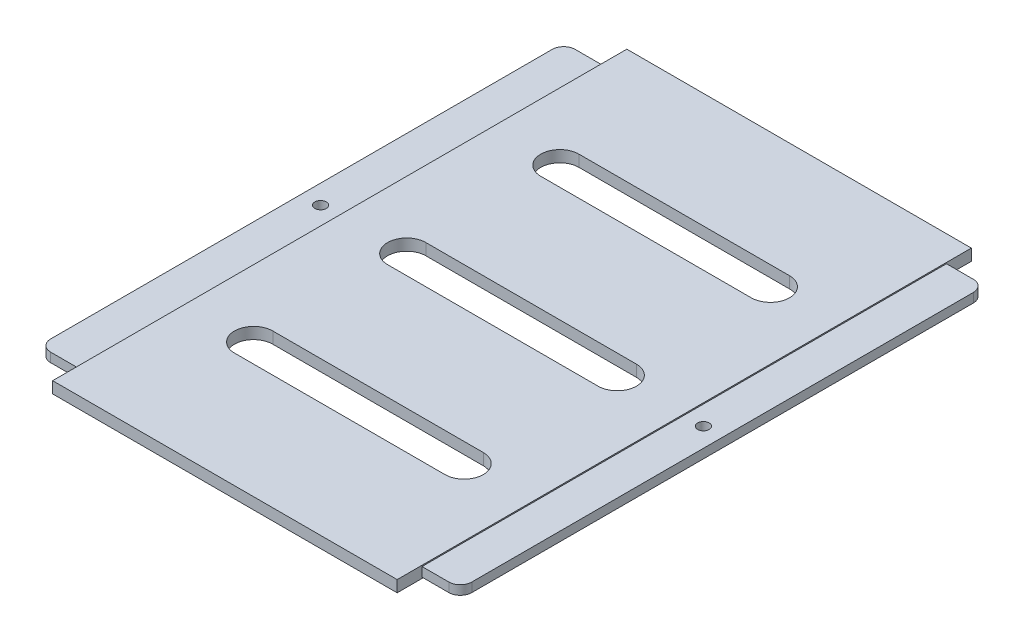
ISO-10303-21;
HEADER;
FILE_DESCRIPTION(('STEP AP214'),'2;1');
FILE_NAME('part.step','',(''),(''),'','','');
FILE_SCHEMA(('AUTOMOTIVE_DESIGN { 1 0 10303 214 1 1 1 1 }'));
ENDSEC;
DATA;
#1=APPLICATION_CONTEXT('core data for automotive mechanical design processes');
#2=APPLICATION_PROTOCOL_DEFINITION('international standard','automotive_design',2000,#1);
#3=PRODUCT_CONTEXT('',#1,'mechanical');
#4=PRODUCT('Part','Part','',(#3));
#5=PRODUCT_RELATED_PRODUCT_CATEGORY('part','',(#4));
#6=PRODUCT_DEFINITION_FORMATION('','',#4);
#7=PRODUCT_DEFINITION_CONTEXT('part definition',#1,'design');
#8=PRODUCT_DEFINITION('design','',#6,#7);
#9=PRODUCT_DEFINITION_SHAPE('','',#8);
#10=(LENGTH_UNIT() NAMED_UNIT(*) SI_UNIT(.MILLI.,.METRE.));
#11=(NAMED_UNIT(*) PLANE_ANGLE_UNIT() SI_UNIT($,.RADIAN.));
#12=(NAMED_UNIT(*) SI_UNIT($,.STERADIAN.) SOLID_ANGLE_UNIT());
#13=UNCERTAINTY_MEASURE_WITH_UNIT(LENGTH_MEASURE(1.E-05),#10,'distance_accuracy_value','');
#14=(GEOMETRIC_REPRESENTATION_CONTEXT(3) GLOBAL_UNCERTAINTY_ASSIGNED_CONTEXT((#13)) GLOBAL_UNIT_ASSIGNED_CONTEXT((#10,
#11,#12)) REPRESENTATION_CONTEXT('',''));
#15=CARTESIAN_POINT('',(0.,0.,0.));
#16=DIRECTION('',(0.,0.,1.));
#17=DIRECTION('',(1.,0.,0.));
#18=AXIS2_PLACEMENT_3D('',#15,#16,#17);
#19=CARTESIAN_POINT('',(45.,3.,-75.));
#20=DIRECTION('',(-1.,0.,0.));
#21=DIRECTION('',(0.,0.,1.));
#22=AXIS2_PLACEMENT_3D('',#19,#20,#21);
#23=PLANE('',#22);
#24=DIRECTION('',(0.,0.,-1.));
#25=VECTOR('',#24,1.);
#26=CARTESIAN_POINT('',(45.,2.7,0.));
#27=LINE('',#26,#25);
#28=CARTESIAN_POINT('',(45.,2.7,68.5));
#29=VERTEX_POINT('',#28);
#30=CARTESIAN_POINT('',(45.,2.7,-68.5));
#31=VERTEX_POINT('',#30);
#32=EDGE_CURVE('E275',#29,#31,#27,.T.);
#33=ORIENTED_EDGE('',*,*,#32,.T.);
#34=DIRECTION('',(0.,-1.,0.));
#35=VECTOR('',#34,1.);
#36=CARTESIAN_POINT('',(45.,0.,-68.5));
#37=LINE('',#36,#35);
#38=CARTESIAN_POINT('',(45.,0.3,-68.5));
#39=VERTEX_POINT('',#38);
#40=EDGE_CURVE('E264',#31,#39,#37,.T.);
#41=ORIENTED_EDGE('',*,*,#40,.T.);
#42=DIRECTION('',(0.,0.,-1.));
#43=VECTOR('',#42,1.);
#44=CARTESIAN_POINT('',(45.,0.3,0.));
#45=LINE('',#44,#43);
#46=CARTESIAN_POINT('',(45.,0.3,68.5));
#47=VERTEX_POINT('',#46);
#48=EDGE_CURVE('E269',#47,#39,#45,.T.);
#49=ORIENTED_EDGE('',*,*,#48,.F.);
#50=DIRECTION('',(0.,-1.,0.));
#51=VECTOR('',#50,1.);
#52=CARTESIAN_POINT('',(45.,0.,68.5));
#53=LINE('',#52,#51);
#54=EDGE_CURVE('E278',#29,#47,#53,.T.);
#55=ORIENTED_EDGE('',*,*,#54,.F.);
#56=EDGE_LOOP('',(#33,#41,#49,#55));
#57=FACE_BOUND('',#56,.T.);
#58=DIRECTION('',(0.,0.,-1.));
#59=VECTOR('',#58,1.);
#60=CARTESIAN_POINT('',(45.,0.,-75.));
#61=LINE('',#60,#59);
#62=CARTESIAN_POINT('',(45.,0.,75.));
#63=VERTEX_POINT('',#62);
#64=CARTESIAN_POINT('',(45.,0.,-75.));
#65=VERTEX_POINT('',#64);
#66=EDGE_CURVE('E318',#63,#65,#61,.T.);
#67=ORIENTED_EDGE('',*,*,#66,.T.);
#68=DIRECTION('',(0.,-1.,0.));
#69=VECTOR('',#68,1.);
#70=CARTESIAN_POINT('',(45.,3.,-75.));
#71=LINE('',#70,#69);
#72=CARTESIAN_POINT('',(45.,3.,-75.));
#73=VERTEX_POINT('',#72);
#74=EDGE_CURVE('E413',#73,#65,#71,.T.);
#75=ORIENTED_EDGE('',*,*,#74,.F.);
#76=DIRECTION('',(0.,0.,-1.));
#77=VECTOR('',#76,1.);
#78=CARTESIAN_POINT('',(45.,3.,-75.));
#79=LINE('',#78,#77);
#80=CARTESIAN_POINT('',(45.,3.,75.));
#81=VERTEX_POINT('',#80);
#82=EDGE_CURVE('E387',#81,#73,#79,.T.);
#83=ORIENTED_EDGE('',*,*,#82,.F.);
#84=DIRECTION('',(0.,-1.,0.));
#85=VECTOR('',#84,1.);
#86=CARTESIAN_POINT('',(45.,3.,75.));
#87=LINE('',#86,#85);
#88=EDGE_CURVE('E397',#81,#63,#87,.T.);
#89=ORIENTED_EDGE('',*,*,#88,.T.);
#90=EDGE_LOOP('',(#67,#75,#83,#89));
#91=FACE_BOUND('',#90,.T.);
#92=ADVANCED_FACE('F44',(#57,#91),#23,.F.);
#93=CARTESIAN_POINT('',(-45.,3.,-75.));
#94=DIRECTION('',(0.,0.,1.));
#95=DIRECTION('',(1.,0.,0.));
#96=AXIS2_PLACEMENT_3D('',#93,#94,#95);
#97=PLANE('',#96);
#98=DIRECTION('',(-1.,0.,0.));
#99=VECTOR('',#98,1.);
#100=CARTESIAN_POINT('',(-45.,0.,-75.));
#101=LINE('',#100,#99);
#102=CARTESIAN_POINT('',(-45.,0.,-75.));
#103=VERTEX_POINT('',#102);
#104=EDGE_CURVE('E400',#65,#103,#101,.T.);
#105=ORIENTED_EDGE('',*,*,#104,.T.);
#106=DIRECTION('',(0.,-1.,0.));
#107=VECTOR('',#106,1.);
#108=CARTESIAN_POINT('',(-45.,3.,-75.));
#109=LINE('',#108,#107);
#110=CARTESIAN_POINT('',(-45.,3.,-75.));
#111=VERTEX_POINT('',#110);
#112=EDGE_CURVE('E410',#111,#103,#109,.T.);
#113=ORIENTED_EDGE('',*,*,#112,.F.);
#114=DIRECTION('',(-1.,0.,0.));
#115=VECTOR('',#114,1.);
#116=CARTESIAN_POINT('',(-45.,3.,-75.));
#117=LINE('',#116,#115);
#118=EDGE_CURVE('E390',#73,#111,#117,.T.);
#119=ORIENTED_EDGE('',*,*,#118,.F.);
#120=ORIENTED_EDGE('',*,*,#74,.T.);
#121=EDGE_LOOP('',(#105,#113,#119,#120));
#122=FACE_BOUND('',#121,.T.);
#123=ADVANCED_FACE('F484',(#122),#97,.F.);
#124=CARTESIAN_POINT('',(-45.,3.,-75.));
#125=DIRECTION('',(1.,0.,0.));
#126=DIRECTION('',(0.,0.,-1.));
#127=AXIS2_PLACEMENT_3D('',#124,#125,#126);
#128=PLANE('',#127);
#129=DIRECTION('',(0.,0.,1.));
#130=VECTOR('',#129,1.);
#131=CARTESIAN_POINT('',(-45.,2.7,0.));
#132=LINE('',#131,#130);
#133=CARTESIAN_POINT('',(-45.,2.7,-68.5000000000002));
#134=VERTEX_POINT('',#133);
#135=CARTESIAN_POINT('',(-45.,2.7,68.4999999999998));
#136=VERTEX_POINT('',#135);
#137=EDGE_CURVE('E242',#134,#136,#132,.T.);
#138=ORIENTED_EDGE('',*,*,#137,.T.);
#139=DIRECTION('',(0.,-1.,0.));
#140=VECTOR('',#139,1.);
#141=CARTESIAN_POINT('',(-45.,0.,68.4999999999998));
#142=LINE('',#141,#140);
#143=CARTESIAN_POINT('',(-45.,0.3,68.4999999999998));
#144=VERTEX_POINT('',#143);
#145=EDGE_CURVE('E248',#136,#144,#142,.T.);
#146=ORIENTED_EDGE('',*,*,#145,.T.);
#147=DIRECTION('',(0.,0.,1.));
#148=VECTOR('',#147,1.);
#149=CARTESIAN_POINT('',(-45.,0.3,0.));
#150=LINE('',#149,#148);
#151=CARTESIAN_POINT('',(-45.,0.3,-68.5000000000002));
#152=VERTEX_POINT('',#151);
#153=EDGE_CURVE('E253',#152,#144,#150,.T.);
#154=ORIENTED_EDGE('',*,*,#153,.F.);
#155=DIRECTION('',(0.,-1.,0.));
#156=VECTOR('',#155,1.);
#157=CARTESIAN_POINT('',(-45.,0.,-68.5000000000002));
#158=LINE('',#157,#156);
#159=EDGE_CURVE('E234',#134,#152,#158,.T.);
#160=ORIENTED_EDGE('',*,*,#159,.F.);
#161=EDGE_LOOP('',(#138,#146,#154,#160));
#162=FACE_BOUND('',#161,.T.);
#163=DIRECTION('',(0.,0.,1.));
#164=VECTOR('',#163,1.);
#165=CARTESIAN_POINT('',(-45.,0.,-75.));
#166=LINE('',#165,#164);
#167=CARTESIAN_POINT('',(-45.,0.,75.));
#168=VERTEX_POINT('',#167);
#169=EDGE_CURVE('E402',#103,#168,#166,.T.);
#170=ORIENTED_EDGE('',*,*,#169,.T.);
#171=DIRECTION('',(0.,-1.,0.));
#172=VECTOR('',#171,1.);
#173=CARTESIAN_POINT('',(-45.,3.,75.));
#174=LINE('',#173,#172);
#175=CARTESIAN_POINT('',(-45.,3.,75.));
#176=VERTEX_POINT('',#175);
#177=EDGE_CURVE('E407',#176,#168,#174,.T.);
#178=ORIENTED_EDGE('',*,*,#177,.F.);
#179=DIRECTION('',(0.,0.,1.));
#180=VECTOR('',#179,1.);
#181=CARTESIAN_POINT('',(-45.,3.,-75.));
#182=LINE('',#181,#180);
#183=EDGE_CURVE('E393',#111,#176,#182,.T.);
#184=ORIENTED_EDGE('',*,*,#183,.F.);
#185=ORIENTED_EDGE('',*,*,#112,.T.);
#186=EDGE_LOOP('',(#170,#178,#184,#185));
#187=FACE_BOUND('',#186,.T.);
#188=ADVANCED_FACE('F250',(#162,#187),#128,.F.);
#189=CARTESIAN_POINT('',(-45.,3.,75.));
#190=DIRECTION('',(0.,0.,-1.));
#191=DIRECTION('',(-1.,0.,0.));
#192=AXIS2_PLACEMENT_3D('',#189,#190,#191);
#193=PLANE('',#192);
#194=DIRECTION('',(1.,0.,0.));
#195=VECTOR('',#194,1.);
#196=CARTESIAN_POINT('',(-45.,0.,75.));
#197=LINE('',#196,#195);
#198=EDGE_CURVE('E391',#168,#63,#197,.T.);
#199=ORIENTED_EDGE('',*,*,#198,.T.);
#200=ORIENTED_EDGE('',*,*,#88,.F.);
#201=DIRECTION('',(1.,0.,0.));
#202=VECTOR('',#201,1.);
#203=CARTESIAN_POINT('',(-45.,3.,75.));
#204=LINE('',#203,#202);
#205=EDGE_CURVE('E395',#176,#81,#204,.T.);
#206=ORIENTED_EDGE('',*,*,#205,.F.);
#207=ORIENTED_EDGE('',*,*,#177,.T.);
#208=EDGE_LOOP('',(#199,#200,#206,#207));
#209=FACE_BOUND('',#208,.T.);
#210=ADVANCED_FACE('F596',(#209),#193,.F.);
#211=CARTESIAN_POINT('',(0.,3.,0.));
#212=DIRECTION('',(0.,1.,0.));
#213=DIRECTION('',(0.,0.,1.));
#214=AXIS2_PLACEMENT_3D('',#211,#212,#213);
#215=PLANE('',#214);
#216=DIRECTION('',(1.,0.,0.));
#217=VECTOR('',#216,1.);
#218=CARTESIAN_POINT('',(0.,3.,-35.));
#219=LINE('',#218,#217);
#220=CARTESIAN_POINT('',(-27.5,3.,-35.));
#221=VERTEX_POINT('',#220);
#222=CARTESIAN_POINT('',(27.5,3.,-35.));
#223=VERTEX_POINT('',#222);
#224=EDGE_CURVE('E305',#221,#223,#219,.T.);
#225=ORIENTED_EDGE('',*,*,#224,.F.);
#226=CARTESIAN_POINT('',(-27.5,3.,-40.));
#227=DIRECTION('',(0.,1.,0.));
#228=DIRECTION('',(0.,0.,1.));
#229=AXIS2_PLACEMENT_3D('',#226,#227,#228);
#230=CIRCLE('',#229,5.);
#231=CARTESIAN_POINT('',(-27.5,3.,-45.));
#232=VERTEX_POINT('',#231);
#233=EDGE_CURVE('E295',#232,#221,#230,.T.);
#234=ORIENTED_EDGE('',*,*,#233,.F.);
#235=DIRECTION('',(1.,0.,0.));
#236=VECTOR('',#235,1.);
#237=CARTESIAN_POINT('',(0.,3.,-45.));
#238=LINE('',#237,#236);
#239=CARTESIAN_POINT('',(27.5,3.,-45.));
#240=VERTEX_POINT('',#239);
#241=EDGE_CURVE('E311',#232,#240,#238,.T.);
#242=ORIENTED_EDGE('',*,*,#241,.T.);
#243=CARTESIAN_POINT('',(27.5,3.,-40.));
#244=DIRECTION('',(0.,1.,0.));
#245=DIRECTION('',(0.,0.,1.));
#246=AXIS2_PLACEMENT_3D('',#243,#244,#245);
#247=CIRCLE('',#246,4.99999999999999);
#248=EDGE_CURVE('E307',#223,#240,#247,.T.);
#249=ORIENTED_EDGE('',*,*,#248,.F.);
#250=EDGE_LOOP('',(#225,#234,#242,#249));
#251=FACE_BOUND('',#250,.T.);
#252=DIRECTION('',(1.,0.,0.));
#253=VECTOR('',#252,1.);
#254=CARTESIAN_POINT('',(0.,3.,4.99999999999999));
#255=LINE('',#254,#253);
#256=CARTESIAN_POINT('',(-27.5,3.,5.));
#257=VERTEX_POINT('',#256);
#258=CARTESIAN_POINT('',(27.5,3.,4.99999999999998));
#259=VERTEX_POINT('',#258);
#260=EDGE_CURVE('E339',#257,#259,#255,.T.);
#261=ORIENTED_EDGE('',*,*,#260,.F.);
#262=CARTESIAN_POINT('',(-27.5,3.,0.));
#263=DIRECTION('',(0.,1.,0.));
#264=DIRECTION('',(0.,0.,1.));
#265=AXIS2_PLACEMENT_3D('',#262,#263,#264);
#266=CIRCLE('',#265,5.);
#267=CARTESIAN_POINT('',(-27.5,3.,-5.));
#268=VERTEX_POINT('',#267);
#269=EDGE_CURVE('E329',#268,#257,#266,.T.);
#270=ORIENTED_EDGE('',*,*,#269,.F.);
#271=DIRECTION('',(1.,0.,0.));
#272=VECTOR('',#271,1.);
#273=CARTESIAN_POINT('',(0.,3.,-4.99999999999999));
#274=LINE('',#273,#272);
#275=CARTESIAN_POINT('',(27.5,3.,-4.99999999999999));
#276=VERTEX_POINT('',#275);
#277=EDGE_CURVE('E345',#268,#276,#274,.T.);
#278=ORIENTED_EDGE('',*,*,#277,.T.);
#279=CARTESIAN_POINT('',(27.5,3.,0.));
#280=DIRECTION('',(0.,1.,0.));
#281=DIRECTION('',(0.,0.,1.));
#282=AXIS2_PLACEMENT_3D('',#279,#280,#281);
#283=CIRCLE('',#282,4.99999999999999);
#284=EDGE_CURVE('E341',#259,#276,#283,.T.);
#285=ORIENTED_EDGE('',*,*,#284,.F.);
#286=EDGE_LOOP('',(#261,#270,#278,#285));
#287=FACE_BOUND('',#286,.T.);
#288=DIRECTION('',(1.,0.,0.));
#289=VECTOR('',#288,1.);
#290=CARTESIAN_POINT('',(0.,3.,45.));
#291=LINE('',#290,#289);
#292=CARTESIAN_POINT('',(-27.5,3.,45.));
#293=VERTEX_POINT('',#292);
#294=CARTESIAN_POINT('',(27.5,3.,45.));
#295=VERTEX_POINT('',#294);
#296=EDGE_CURVE('E290',#293,#295,#291,.T.);
#297=ORIENTED_EDGE('',*,*,#296,.F.);
#298=CARTESIAN_POINT('',(-27.5,3.,40.));
#299=DIRECTION('',(0.,1.,0.));
#300=DIRECTION('',(0.,0.,1.));
#301=AXIS2_PLACEMENT_3D('',#298,#299,#300);
#302=CIRCLE('',#301,5.);
#303=CARTESIAN_POINT('',(-27.5,3.,35.));
#304=VERTEX_POINT('',#303);
#305=EDGE_CURVE('E361',#304,#293,#302,.T.);
#306=ORIENTED_EDGE('',*,*,#305,.F.);
#307=DIRECTION('',(1.,0.,0.));
#308=VECTOR('',#307,1.);
#309=CARTESIAN_POINT('',(0.,3.,35.));
#310=LINE('',#309,#308);
#311=CARTESIAN_POINT('',(27.5,3.,35.));
#312=VERTEX_POINT('',#311);
#313=EDGE_CURVE('E375',#304,#312,#310,.T.);
#314=ORIENTED_EDGE('',*,*,#313,.T.);
#315=CARTESIAN_POINT('',(27.5,3.,40.));
#316=DIRECTION('',(0.,1.,0.));
#317=DIRECTION('',(0.,0.,1.));
#318=AXIS2_PLACEMENT_3D('',#315,#316,#317);
#319=CIRCLE('',#318,4.99999999999999);
#320=EDGE_CURVE('E372',#295,#312,#319,.T.);
#321=ORIENTED_EDGE('',*,*,#320,.F.);
#322=EDGE_LOOP('',(#297,#306,#314,#321));
#323=FACE_BOUND('',#322,.T.);
#324=ORIENTED_EDGE('',*,*,#82,.T.);
#325=ORIENTED_EDGE('',*,*,#118,.T.);
#326=ORIENTED_EDGE('',*,*,#183,.T.);
#327=ORIENTED_EDGE('',*,*,#205,.T.);
#328=EDGE_LOOP('',(#324,#325,#326,#327));
#329=FACE_BOUND('',#328,.T.);
#330=ADVANCED_FACE('F593',(#251,#287,#323,#329),#215,.T.);
#331=CARTESIAN_POINT('',(0.,0.,0.));
#332=DIRECTION('',(0.,1.,0.));
#333=DIRECTION('',(0.,0.,1.));
#334=AXIS2_PLACEMENT_3D('',#331,#332,#333);
#335=PLANE('',#334);
#336=CARTESIAN_POINT('',(-27.5,0.,-40.));
#337=DIRECTION('',(0.,1.,0.));
#338=DIRECTION('',(0.,0.,1.));
#339=AXIS2_PLACEMENT_3D('',#336,#337,#338);
#340=CIRCLE('',#339,5.);
#341=CARTESIAN_POINT('',(-27.5,0.,-45.));
#342=VERTEX_POINT('',#341);
#343=CARTESIAN_POINT('',(-27.5,0.,-35.));
#344=VERTEX_POINT('',#343);
#345=EDGE_CURVE('E301',#342,#344,#340,.T.);
#346=ORIENTED_EDGE('',*,*,#345,.T.);
#347=DIRECTION('',(1.,0.,0.));
#348=VECTOR('',#347,1.);
#349=CARTESIAN_POINT('',(0.,0.,-35.));
#350=LINE('',#349,#348);
#351=CARTESIAN_POINT('',(27.5,0.,-35.));
#352=VERTEX_POINT('',#351);
#353=EDGE_CURVE('E291',#344,#352,#350,.T.);
#354=ORIENTED_EDGE('',*,*,#353,.T.);
#355=CARTESIAN_POINT('',(27.5,0.,-40.));
#356=DIRECTION('',(0.,1.,0.));
#357=DIRECTION('',(0.,0.,1.));
#358=AXIS2_PLACEMENT_3D('',#355,#356,#357);
#359=CIRCLE('',#358,4.99999999999999);
#360=CARTESIAN_POINT('',(27.5,0.,-45.));
#361=VERTEX_POINT('',#360);
#362=EDGE_CURVE('E294',#352,#361,#359,.T.);
#363=ORIENTED_EDGE('',*,*,#362,.T.);
#364=DIRECTION('',(1.,0.,0.));
#365=VECTOR('',#364,1.);
#366=CARTESIAN_POINT('',(0.,0.,-45.));
#367=LINE('',#366,#365);
#368=EDGE_CURVE('E298',#342,#361,#367,.T.);
#369=ORIENTED_EDGE('',*,*,#368,.F.);
#370=EDGE_LOOP('',(#346,#354,#363,#369));
#371=FACE_BOUND('',#370,.T.);
#372=CARTESIAN_POINT('',(-27.5,0.,0.));
#373=DIRECTION('',(0.,1.,0.));
#374=DIRECTION('',(0.,0.,1.));
#375=AXIS2_PLACEMENT_3D('',#372,#373,#374);
#376=CIRCLE('',#375,5.);
#377=CARTESIAN_POINT('',(-27.5,0.,-5.));
#378=VERTEX_POINT('',#377);
#379=CARTESIAN_POINT('',(-27.5,0.,5.));
#380=VERTEX_POINT('',#379);
#381=EDGE_CURVE('E335',#378,#380,#376,.T.);
#382=ORIENTED_EDGE('',*,*,#381,.T.);
#383=DIRECTION('',(1.,0.,0.));
#384=VECTOR('',#383,1.);
#385=CARTESIAN_POINT('',(0.,0.,4.99999999999999));
#386=LINE('',#385,#384);
#387=CARTESIAN_POINT('',(27.5,0.,4.99999999999999));
#388=VERTEX_POINT('',#387);
#389=EDGE_CURVE('E325',#380,#388,#386,.T.);
#390=ORIENTED_EDGE('',*,*,#389,.T.);
#391=CARTESIAN_POINT('',(27.5,0.,0.));
#392=DIRECTION('',(0.,1.,0.));
#393=DIRECTION('',(0.,0.,1.));
#394=AXIS2_PLACEMENT_3D('',#391,#392,#393);
#395=CIRCLE('',#394,4.99999999999999);
#396=CARTESIAN_POINT('',(27.5,0.,-5.));
#397=VERTEX_POINT('',#396);
#398=EDGE_CURVE('E328',#388,#397,#395,.T.);
#399=ORIENTED_EDGE('',*,*,#398,.T.);
#400=DIRECTION('',(1.,0.,0.));
#401=VECTOR('',#400,1.);
#402=CARTESIAN_POINT('',(0.,0.,-4.99999999999999));
#403=LINE('',#402,#401);
#404=EDGE_CURVE('E332',#378,#397,#403,.T.);
#405=ORIENTED_EDGE('',*,*,#404,.F.);
#406=EDGE_LOOP('',(#382,#390,#399,#405));
#407=FACE_BOUND('',#406,.T.);
#408=CARTESIAN_POINT('',(-27.5,0.,40.));
#409=DIRECTION('',(0.,1.,0.));
#410=DIRECTION('',(0.,0.,1.));
#411=AXIS2_PLACEMENT_3D('',#408,#409,#410);
#412=CIRCLE('',#411,5.);
#413=CARTESIAN_POINT('',(-27.5,0.,35.));
#414=VERTEX_POINT('',#413);
#415=CARTESIAN_POINT('',(-27.5,0.,45.));
#416=VERTEX_POINT('',#415);
#417=EDGE_CURVE('E367',#414,#416,#412,.T.);
#418=ORIENTED_EDGE('',*,*,#417,.T.);
#419=DIRECTION('',(1.,0.,0.));
#420=VECTOR('',#419,1.);
#421=CARTESIAN_POINT('',(0.,0.,45.));
#422=LINE('',#421,#420);
#423=CARTESIAN_POINT('',(27.5,0.,45.));
#424=VERTEX_POINT('',#423);
#425=EDGE_CURVE('E357',#416,#424,#422,.T.);
#426=ORIENTED_EDGE('',*,*,#425,.T.);
#427=CARTESIAN_POINT('',(27.5,0.,40.));
#428=DIRECTION('',(0.,1.,0.));
#429=DIRECTION('',(0.,0.,1.));
#430=AXIS2_PLACEMENT_3D('',#427,#428,#429);
#431=CIRCLE('',#430,4.99999999999999);
#432=CARTESIAN_POINT('',(27.5,0.,35.));
#433=VERTEX_POINT('',#432);
#434=EDGE_CURVE('E360',#424,#433,#431,.T.);
#435=ORIENTED_EDGE('',*,*,#434,.T.);
#436=DIRECTION('',(1.,0.,0.));
#437=VECTOR('',#436,1.);
#438=CARTESIAN_POINT('',(0.,0.,35.));
#439=LINE('',#438,#437);
#440=EDGE_CURVE('E364',#414,#433,#439,.T.);
#441=ORIENTED_EDGE('',*,*,#440,.F.);
#442=EDGE_LOOP('',(#418,#426,#435,#441));
#443=FACE_BOUND('',#442,.T.);
#444=ORIENTED_EDGE('',*,*,#66,.F.);
#445=ORIENTED_EDGE('',*,*,#198,.F.);
#446=ORIENTED_EDGE('',*,*,#169,.F.);
#447=ORIENTED_EDGE('',*,*,#104,.F.);
#448=EDGE_LOOP('',(#444,#445,#446,#447));
#449=FACE_BOUND('',#448,.T.);
#450=ADVANCED_FACE('F591',(#371,#407,#443,#449),#335,.F.);
#451=CARTESIAN_POINT('',(0.,0.,45.));
#452=DIRECTION('',(0.,0.,1.));
#453=DIRECTION('',(1.,0.,0.));
#454=AXIS2_PLACEMENT_3D('',#451,#452,#453);
#455=PLANE('',#454);
#456=ORIENTED_EDGE('',*,*,#296,.T.);
#457=DIRECTION('',(0.,1.,0.));
#458=VECTOR('',#457,1.);
#459=CARTESIAN_POINT('',(27.5,0.,45.));
#460=LINE('',#459,#458);
#461=EDGE_CURVE('E370',#424,#295,#460,.T.);
#462=ORIENTED_EDGE('',*,*,#461,.F.);
#463=ORIENTED_EDGE('',*,*,#425,.F.);
#464=DIRECTION('',(0.,1.,0.));
#465=VECTOR('',#464,1.);
#466=CARTESIAN_POINT('',(-27.5,0.,45.));
#467=LINE('',#466,#465);
#468=EDGE_CURVE('E342',#416,#293,#467,.T.);
#469=ORIENTED_EDGE('',*,*,#468,.T.);
#470=EDGE_LOOP('',(#456,#462,#463,#469));
#471=FACE_BOUND('',#470,.T.);
#472=ADVANCED_FACE('F581',(#471),#455,.F.);
#473=CARTESIAN_POINT('',(-27.5,0.,40.));
#474=DIRECTION('',(0.,1.,0.));
#475=DIRECTION('',(0.,0.,1.));
#476=AXIS2_PLACEMENT_3D('',#473,#474,#475);
#477=CYLINDRICAL_SURFACE('',#476,5.);
#478=ORIENTED_EDGE('',*,*,#305,.T.);
#479=ORIENTED_EDGE('',*,*,#468,.F.);
#480=ORIENTED_EDGE('',*,*,#417,.F.);
#481=DIRECTION('',(0.,1.,0.));
#482=VECTOR('',#481,1.);
#483=CARTESIAN_POINT('',(-27.5,0.,35.));
#484=LINE('',#483,#482);
#485=EDGE_CURVE('E381',#414,#304,#484,.T.);
#486=ORIENTED_EDGE('',*,*,#485,.T.);
#487=EDGE_LOOP('',(#478,#479,#480,#486));
#488=FACE_BOUND('',#487,.T.);
#489=ADVANCED_FACE('F577',(#488),#477,.F.);
#490=CARTESIAN_POINT('',(0.,0.,35.));
#491=DIRECTION('',(0.,0.,1.));
#492=DIRECTION('',(1.,0.,0.));
#493=AXIS2_PLACEMENT_3D('',#490,#491,#492);
#494=PLANE('',#493);
#495=ORIENTED_EDGE('',*,*,#313,.F.);
#496=ORIENTED_EDGE('',*,*,#485,.F.);
#497=ORIENTED_EDGE('',*,*,#440,.T.);
#498=DIRECTION('',(0.,1.,0.));
#499=VECTOR('',#498,1.);
#500=CARTESIAN_POINT('',(27.5,0.,35.));
#501=LINE('',#500,#499);
#502=EDGE_CURVE('E383',#433,#312,#501,.T.);
#503=ORIENTED_EDGE('',*,*,#502,.T.);
#504=EDGE_LOOP('',(#495,#496,#497,#503));
#505=FACE_BOUND('',#504,.T.);
#506=ADVANCED_FACE('F580',(#505),#494,.T.);
#507=CARTESIAN_POINT('',(27.5,0.,40.));
#508=DIRECTION('',(0.,1.,0.));
#509=DIRECTION('',(0.,0.,1.));
#510=AXIS2_PLACEMENT_3D('',#507,#508,#509);
#511=CYLINDRICAL_SURFACE('',#510,4.99999999999999);
#512=ORIENTED_EDGE('',*,*,#320,.T.);
#513=ORIENTED_EDGE('',*,*,#502,.F.);
#514=ORIENTED_EDGE('',*,*,#434,.F.);
#515=ORIENTED_EDGE('',*,*,#461,.T.);
#516=EDGE_LOOP('',(#512,#513,#514,#515));
#517=FACE_BOUND('',#516,.T.);
#518=ADVANCED_FACE('F575',(#517),#511,.F.);
#519=CARTESIAN_POINT('',(0.,0.,4.99999999999999));
#520=DIRECTION('',(0.,0.,1.));
#521=DIRECTION('',(1.,0.,0.));
#522=AXIS2_PLACEMENT_3D('',#519,#520,#521);
#523=PLANE('',#522);
#524=ORIENTED_EDGE('',*,*,#260,.T.);
#525=DIRECTION('',(0.,1.,0.));
#526=VECTOR('',#525,1.);
#527=CARTESIAN_POINT('',(27.5,0.,4.99999999999999));
#528=LINE('',#527,#526);
#529=EDGE_CURVE('E338',#388,#259,#528,.T.);
#530=ORIENTED_EDGE('',*,*,#529,.F.);
#531=ORIENTED_EDGE('',*,*,#389,.F.);
#532=DIRECTION('',(0.,1.,0.));
#533=VECTOR('',#532,1.);
#534=CARTESIAN_POINT('',(-27.5,0.,5.));
#535=LINE('',#534,#533);
#536=EDGE_CURVE('E308',#380,#257,#535,.T.);
#537=ORIENTED_EDGE('',*,*,#536,.T.);
#538=EDGE_LOOP('',(#524,#530,#531,#537));
#539=FACE_BOUND('',#538,.T.);
#540=ADVANCED_FACE('F565',(#539),#523,.F.);
#541=CARTESIAN_POINT('',(-27.5,0.,0.));
#542=DIRECTION('',(0.,1.,0.));
#543=DIRECTION('',(0.,0.,1.));
#544=AXIS2_PLACEMENT_3D('',#541,#542,#543);
#545=CYLINDRICAL_SURFACE('',#544,5.);
#546=ORIENTED_EDGE('',*,*,#269,.T.);
#547=ORIENTED_EDGE('',*,*,#536,.F.);
#548=ORIENTED_EDGE('',*,*,#381,.F.);
#549=DIRECTION('',(0.,1.,0.));
#550=VECTOR('',#549,1.);
#551=CARTESIAN_POINT('',(-27.5,0.,-5.));
#552=LINE('',#551,#550);
#553=EDGE_CURVE('E351',#378,#268,#552,.T.);
#554=ORIENTED_EDGE('',*,*,#553,.T.);
#555=EDGE_LOOP('',(#546,#547,#548,#554));
#556=FACE_BOUND('',#555,.T.);
#557=ADVANCED_FACE('F561',(#556),#545,.F.);
#558=CARTESIAN_POINT('',(0.,0.,-4.99999999999999));
#559=DIRECTION('',(0.,0.,1.));
#560=DIRECTION('',(1.,0.,0.));
#561=AXIS2_PLACEMENT_3D('',#558,#559,#560);
#562=PLANE('',#561);
#563=ORIENTED_EDGE('',*,*,#277,.F.);
#564=ORIENTED_EDGE('',*,*,#553,.F.);
#565=ORIENTED_EDGE('',*,*,#404,.T.);
#566=DIRECTION('',(0.,1.,0.));
#567=VECTOR('',#566,1.);
#568=CARTESIAN_POINT('',(27.5,0.,-4.99999999999999));
#569=LINE('',#568,#567);
#570=EDGE_CURVE('E353',#397,#276,#569,.T.);
#571=ORIENTED_EDGE('',*,*,#570,.T.);
#572=EDGE_LOOP('',(#563,#564,#565,#571));
#573=FACE_BOUND('',#572,.T.);
#574=ADVANCED_FACE('F564',(#573),#562,.T.);
#575=CARTESIAN_POINT('',(27.5,0.,0.));
#576=DIRECTION('',(0.,1.,0.));
#577=DIRECTION('',(0.,0.,1.));
#578=AXIS2_PLACEMENT_3D('',#575,#576,#577);
#579=CYLINDRICAL_SURFACE('',#578,4.99999999999999);
#580=ORIENTED_EDGE('',*,*,#284,.T.);
#581=ORIENTED_EDGE('',*,*,#570,.F.);
#582=ORIENTED_EDGE('',*,*,#398,.F.);
#583=ORIENTED_EDGE('',*,*,#529,.T.);
#584=EDGE_LOOP('',(#580,#581,#582,#583));
#585=FACE_BOUND('',#584,.T.);
#586=ADVANCED_FACE('F559',(#585),#579,.F.);
#587=CARTESIAN_POINT('',(0.,0.,-35.));
#588=DIRECTION('',(0.,0.,1.));
#589=DIRECTION('',(1.,0.,0.));
#590=AXIS2_PLACEMENT_3D('',#587,#588,#589);
#591=PLANE('',#590);
#592=ORIENTED_EDGE('',*,*,#224,.T.);
#593=DIRECTION('',(0.,1.,0.));
#594=VECTOR('',#593,1.);
#595=CARTESIAN_POINT('',(27.5,0.,-35.));
#596=LINE('',#595,#594);
#597=EDGE_CURVE('E304',#352,#223,#596,.T.);
#598=ORIENTED_EDGE('',*,*,#597,.F.);
#599=ORIENTED_EDGE('',*,*,#353,.F.);
#600=DIRECTION('',(0.,1.,0.));
#601=VECTOR('',#600,1.);
#602=CARTESIAN_POINT('',(-27.5,0.,-35.));
#603=LINE('',#602,#601);
#604=EDGE_CURVE('E316',#344,#221,#603,.T.);
#605=ORIENTED_EDGE('',*,*,#604,.T.);
#606=EDGE_LOOP('',(#592,#598,#599,#605));
#607=FACE_BOUND('',#606,.T.);
#608=ADVANCED_FACE('F549',(#607),#591,.F.);
#609=CARTESIAN_POINT('',(-27.5,0.,-40.));
#610=DIRECTION('',(0.,1.,0.));
#611=DIRECTION('',(0.,0.,1.));
#612=AXIS2_PLACEMENT_3D('',#609,#610,#611);
#613=CYLINDRICAL_SURFACE('',#612,5.);
#614=ORIENTED_EDGE('',*,*,#233,.T.);
#615=ORIENTED_EDGE('',*,*,#604,.F.);
#616=ORIENTED_EDGE('',*,*,#345,.F.);
#617=DIRECTION('',(0.,1.,0.));
#618=VECTOR('',#617,1.);
#619=CARTESIAN_POINT('',(-27.5,0.,-45.));
#620=LINE('',#619,#618);
#621=EDGE_CURVE('E319',#342,#232,#620,.T.);
#622=ORIENTED_EDGE('',*,*,#621,.T.);
#623=EDGE_LOOP('',(#614,#615,#616,#622));
#624=FACE_BOUND('',#623,.T.);
#625=ADVANCED_FACE('F545',(#624),#613,.F.);
#626=CARTESIAN_POINT('',(0.,0.,-45.));
#627=DIRECTION('',(0.,0.,1.));
#628=DIRECTION('',(1.,0.,0.));
#629=AXIS2_PLACEMENT_3D('',#626,#627,#628);
#630=PLANE('',#629);
#631=ORIENTED_EDGE('',*,*,#241,.F.);
#632=ORIENTED_EDGE('',*,*,#621,.F.);
#633=ORIENTED_EDGE('',*,*,#368,.T.);
#634=DIRECTION('',(0.,1.,0.));
#635=VECTOR('',#634,1.);
#636=CARTESIAN_POINT('',(27.5,0.,-45.));
#637=LINE('',#636,#635);
#638=EDGE_CURVE('E321',#361,#240,#637,.T.);
#639=ORIENTED_EDGE('',*,*,#638,.T.);
#640=EDGE_LOOP('',(#631,#632,#633,#639));
#641=FACE_BOUND('',#640,.T.);
#642=ADVANCED_FACE('F548',(#641),#630,.T.);
#643=CARTESIAN_POINT('',(27.5,0.,-40.));
#644=DIRECTION('',(0.,1.,0.));
#645=DIRECTION('',(0.,0.,1.));
#646=AXIS2_PLACEMENT_3D('',#643,#644,#645);
#647=CYLINDRICAL_SURFACE('',#646,4.99999999999999);
#648=ORIENTED_EDGE('',*,*,#248,.T.);
#649=ORIENTED_EDGE('',*,*,#638,.F.);
#650=ORIENTED_EDGE('',*,*,#362,.F.);
#651=ORIENTED_EDGE('',*,*,#597,.T.);
#652=EDGE_LOOP('',(#648,#649,#650,#651));
#653=FACE_BOUND('',#652,.T.);
#654=ADVANCED_FACE('F544',(#653),#647,.F.);
#655=CARTESIAN_POINT('',(55.,0.,-68.5));
#656=DIRECTION('',(0.,0.,-1.));
#657=DIRECTION('',(-1.,0.,0.));
#658=AXIS2_PLACEMENT_3D('',#655,#656,#657);
#659=PLANE('',#658);
#660=DIRECTION('',(-1.,0.,0.));
#661=VECTOR('',#660,1.);
#662=CARTESIAN_POINT('',(55.,2.7,-68.5));
#663=LINE('',#662,#661);
#664=CARTESIAN_POINT('',(52.,2.7,-68.5));
#665=VERTEX_POINT('',#664);
#666=EDGE_CURVE('E288',#665,#31,#663,.T.);
#667=ORIENTED_EDGE('',*,*,#666,.F.);
#668=DIRECTION('',(0.,-1.,0.));
#669=VECTOR('',#668,1.);
#670=CARTESIAN_POINT('',(52.,0.,-68.5));
#671=LINE('',#670,#669);
#672=CARTESIAN_POINT('',(52.,0.3,-68.5));
#673=VERTEX_POINT('',#672);
#674=EDGE_CURVE('E416',#665,#673,#671,.T.);
#675=ORIENTED_EDGE('',*,*,#674,.T.);
#676=DIRECTION('',(-1.,0.,0.));
#677=VECTOR('',#676,1.);
#678=CARTESIAN_POINT('',(55.,0.3,-68.5));
#679=LINE('',#678,#677);
#680=EDGE_CURVE('E272',#673,#39,#679,.T.);
#681=ORIENTED_EDGE('',*,*,#680,.T.);
#682=ORIENTED_EDGE('',*,*,#40,.F.);
#683=EDGE_LOOP('',(#667,#675,#681,#682));
#684=FACE_BOUND('',#683,.T.);
#685=ADVANCED_FACE('F520',(#684),#659,.T.);
#686=CARTESIAN_POINT('',(55.,2.7,0.));
#687=DIRECTION('',(0.,1.,0.));
#688=DIRECTION('',(0.,0.,1.));
#689=AXIS2_PLACEMENT_3D('',#686,#687,#688);
#690=PLANE('',#689);
#691=CARTESIAN_POINT('',(50.,2.7,0.));
#692=DIRECTION('',(0.,1.,0.));
#693=DIRECTION('',(0.,0.,1.));
#694=AXIS2_PLACEMENT_3D('',#691,#692,#693);
#695=CIRCLE('',#694,1.5);
#696=CARTESIAN_POINT('',(50.,2.7,1.49999999999999));
#697=VERTEX_POINT('',#696);
#698=EDGE_CURVE('E449',#697,#697,#695,.T.);
#699=ORIENTED_EDGE('',*,*,#698,.F.);
#700=EDGE_LOOP('',(#699));
#701=FACE_BOUND('',#700,.T.);
#702=DIRECTION('',(0.,0.,-1.));
#703=VECTOR('',#702,1.);
#704=CARTESIAN_POINT('',(55.,2.7,0.));
#705=LINE('',#704,#703);
#706=CARTESIAN_POINT('',(55.,2.7,65.5));
#707=VERTEX_POINT('',#706);
#708=CARTESIAN_POINT('',(55.,2.7,-65.5));
#709=VERTEX_POINT('',#708);
#710=EDGE_CURVE('E265',#707,#709,#705,.T.);
#711=ORIENTED_EDGE('',*,*,#710,.T.);
#712=CARTESIAN_POINT('',(52.,2.7,-65.5));
#713=DIRECTION('',(0.,1.,0.));
#714=DIRECTION('',(0.,0.,1.));
#715=AXIS2_PLACEMENT_3D('',#712,#713,#714);
#716=CIRCLE('',#715,3.);
#717=EDGE_CURVE('E430',#709,#665,#716,.T.);
#718=ORIENTED_EDGE('',*,*,#717,.T.);
#719=ORIENTED_EDGE('',*,*,#666,.T.);
#720=ORIENTED_EDGE('',*,*,#32,.F.);
#721=DIRECTION('',(-1.,0.,0.));
#722=VECTOR('',#721,1.);
#723=CARTESIAN_POINT('',(55.,2.7,68.5));
#724=LINE('',#723,#722);
#725=CARTESIAN_POINT('',(52.,2.7,68.5));
#726=VERTEX_POINT('',#725);
#727=EDGE_CURVE('E286',#726,#29,#724,.T.);
#728=ORIENTED_EDGE('',*,*,#727,.F.);
#729=CARTESIAN_POINT('',(52.,2.7,65.5));
#730=DIRECTION('',(0.,1.,0.));
#731=DIRECTION('',(0.,0.,1.));
#732=AXIS2_PLACEMENT_3D('',#729,#730,#731);
#733=CIRCLE('',#732,3.);
#734=EDGE_CURVE('E428',#726,#707,#733,.T.);
#735=ORIENTED_EDGE('',*,*,#734,.T.);
#736=EDGE_LOOP('',(#711,#718,#719,#720,#728,#735));
#737=FACE_BOUND('',#736,.T.);
#738=ADVANCED_FACE('F509',(#701,#737),#690,.T.);
#739=CARTESIAN_POINT('',(55.,0.,68.5));
#740=DIRECTION('',(0.,0.,-1.));
#741=DIRECTION('',(-1.,0.,0.));
#742=AXIS2_PLACEMENT_3D('',#739,#740,#741);
#743=PLANE('',#742);
#744=DIRECTION('',(-1.,0.,0.));
#745=VECTOR('',#744,1.);
#746=CARTESIAN_POINT('',(55.,0.3,68.5));
#747=LINE('',#746,#745);
#748=CARTESIAN_POINT('',(52.,0.3,68.5));
#749=VERTEX_POINT('',#748);
#750=EDGE_CURVE('E284',#749,#47,#747,.T.);
#751=ORIENTED_EDGE('',*,*,#750,.F.);
#752=DIRECTION('',(0.,-1.,0.));
#753=VECTOR('',#752,1.);
#754=CARTESIAN_POINT('',(52.,2.7,68.5));
#755=LINE('',#754,#753);
#756=EDGE_CURVE('E432',#749,#726,#755,.F.);
#757=ORIENTED_EDGE('',*,*,#756,.T.);
#758=ORIENTED_EDGE('',*,*,#727,.T.);
#759=ORIENTED_EDGE('',*,*,#54,.T.);
#760=EDGE_LOOP('',(#751,#757,#758,#759));
#761=FACE_BOUND('',#760,.T.);
#762=ADVANCED_FACE('F526',(#761),#743,.F.);
#763=CARTESIAN_POINT('',(55.,0.3,0.));
#764=DIRECTION('',(0.,1.,0.));
#765=DIRECTION('',(0.,0.,1.));
#766=AXIS2_PLACEMENT_3D('',#763,#764,#765);
#767=PLANE('',#766);
#768=CARTESIAN_POINT('',(50.,0.3,0.));
#769=DIRECTION('',(0.,1.,0.));
#770=DIRECTION('',(0.,0.,1.));
#771=AXIS2_PLACEMENT_3D('',#768,#769,#770);
#772=CIRCLE('',#771,1.5);
#773=CARTESIAN_POINT('',(50.,0.3,1.49999999999999));
#774=VERTEX_POINT('',#773);
#775=EDGE_CURVE('E447',#774,#774,#772,.T.);
#776=ORIENTED_EDGE('',*,*,#775,.T.);
#777=EDGE_LOOP('',(#776));
#778=FACE_BOUND('',#777,.T.);
#779=ORIENTED_EDGE('',*,*,#680,.F.);
#780=CARTESIAN_POINT('',(52.,0.3,-65.5));
#781=DIRECTION('',(0.,1.,0.));
#782=DIRECTION('',(0.,0.,1.));
#783=AXIS2_PLACEMENT_3D('',#780,#781,#782);
#784=CIRCLE('',#783,3.);
#785=CARTESIAN_POINT('',(55.,0.3,-65.5));
#786=VERTEX_POINT('',#785);
#787=EDGE_CURVE('E421',#673,#786,#784,.F.);
#788=ORIENTED_EDGE('',*,*,#787,.T.);
#789=DIRECTION('',(0.,0.,-1.));
#790=VECTOR('',#789,1.);
#791=CARTESIAN_POINT('',(55.,0.3,0.));
#792=LINE('',#791,#790);
#793=CARTESIAN_POINT('',(55.,0.3,65.5));
#794=VERTEX_POINT('',#793);
#795=EDGE_CURVE('E268',#794,#786,#792,.T.);
#796=ORIENTED_EDGE('',*,*,#795,.F.);
#797=CARTESIAN_POINT('',(52.,0.3,65.5));
#798=DIRECTION('',(0.,1.,0.));
#799=DIRECTION('',(0.,0.,1.));
#800=AXIS2_PLACEMENT_3D('',#797,#798,#799);
#801=CIRCLE('',#800,3.);
#802=EDGE_CURVE('E419',#794,#749,#801,.F.);
#803=ORIENTED_EDGE('',*,*,#802,.T.);
#804=ORIENTED_EDGE('',*,*,#750,.T.);
#805=ORIENTED_EDGE('',*,*,#48,.T.);
#806=EDGE_LOOP('',(#779,#788,#796,#803,#804,#805));
#807=FACE_BOUND('',#806,.T.);
#808=ADVANCED_FACE('F528',(#778,#807),#767,.F.);
#809=CARTESIAN_POINT('',(55.,0.,0.));
#810=DIRECTION('',(1.,0.,0.));
#811=DIRECTION('',(0.,0.,-1.));
#812=AXIS2_PLACEMENT_3D('',#809,#810,#811);
#813=PLANE('',#812);
#814=ORIENTED_EDGE('',*,*,#795,.T.);
#815=DIRECTION('',(0.,-1.,0.));
#816=VECTOR('',#815,1.);
#817=CARTESIAN_POINT('',(55.,0.,-65.5));
#818=LINE('',#817,#816);
#819=EDGE_CURVE('E426',#786,#709,#818,.F.);
#820=ORIENTED_EDGE('',*,*,#819,.T.);
#821=ORIENTED_EDGE('',*,*,#710,.F.);
#822=DIRECTION('',(0.,-1.,0.));
#823=VECTOR('',#822,1.);
#824=CARTESIAN_POINT('',(55.,0.3,65.5));
#825=LINE('',#824,#823);
#826=EDGE_CURVE('E423',#707,#794,#825,.T.);
#827=ORIENTED_EDGE('',*,*,#826,.T.);
#828=EDGE_LOOP('',(#814,#820,#821,#827));
#829=FACE_BOUND('',#828,.T.);
#830=ADVANCED_FACE('F513',(#829),#813,.T.);
#831=CARTESIAN_POINT('',(-55.,0.,68.4999999999998));
#832=DIRECTION('',(0.,0.,1.));
#833=DIRECTION('',(1.,0.,0.));
#834=AXIS2_PLACEMENT_3D('',#831,#832,#833);
#835=PLANE('',#834);
#836=DIRECTION('',(1.,0.,0.));
#837=VECTOR('',#836,1.);
#838=CARTESIAN_POINT('',(-55.,2.7,68.4999999999998));
#839=LINE('',#838,#837);
#840=CARTESIAN_POINT('',(-52.,2.7,68.4999999999998));
#841=VERTEX_POINT('',#840);
#842=EDGE_CURVE('E238',#841,#136,#839,.T.);
#843=ORIENTED_EDGE('',*,*,#842,.F.);
#844=DIRECTION('',(0.,-1.,0.));
#845=VECTOR('',#844,1.);
#846=CARTESIAN_POINT('',(-52.,0.,68.4999999999998));
#847=LINE('',#846,#845);
#848=CARTESIAN_POINT('',(-52.,0.3,68.4999999999998));
#849=VERTEX_POINT('',#848);
#850=EDGE_CURVE('E434',#841,#849,#847,.T.);
#851=ORIENTED_EDGE('',*,*,#850,.T.);
#852=DIRECTION('',(1.,0.,0.));
#853=VECTOR('',#852,1.);
#854=CARTESIAN_POINT('',(-55.,0.3,68.4999999999998));
#855=LINE('',#854,#853);
#856=EDGE_CURVE('E259',#849,#144,#855,.T.);
#857=ORIENTED_EDGE('',*,*,#856,.T.);
#858=ORIENTED_EDGE('',*,*,#145,.F.);
#859=EDGE_LOOP('',(#843,#851,#857,#858));
#860=FACE_BOUND('',#859,.T.);
#861=ADVANCED_FACE('F470',(#860),#835,.T.);
#862=CARTESIAN_POINT('',(-55.,2.7,0.));
#863=DIRECTION('',(0.,1.,0.));
#864=DIRECTION('',(0.,0.,1.));
#865=AXIS2_PLACEMENT_3D('',#862,#863,#864);
#866=PLANE('',#865);
#867=CARTESIAN_POINT('',(-50.,2.7,-1.80411241501588E-13));
#868=DIRECTION('',(0.,1.,0.));
#869=DIRECTION('',(0.,0.,1.));
#870=AXIS2_PLACEMENT_3D('',#867,#868,#869);
#871=CIRCLE('',#870,1.5);
#872=CARTESIAN_POINT('',(-50.,2.7,1.49999999999982));
#873=VERTEX_POINT('',#872);
#874=EDGE_CURVE('E457',#873,#873,#871,.T.);
#875=ORIENTED_EDGE('',*,*,#874,.F.);
#876=EDGE_LOOP('',(#875));
#877=FACE_BOUND('',#876,.T.);
#878=DIRECTION('',(0.,0.,1.));
#879=VECTOR('',#878,1.);
#880=CARTESIAN_POINT('',(-55.,2.7,0.));
#881=LINE('',#880,#879);
#882=CARTESIAN_POINT('',(-55.,2.7,-65.5000000000002));
#883=VERTEX_POINT('',#882);
#884=CARTESIAN_POINT('',(-55.,2.7,65.4999999999998));
#885=VERTEX_POINT('',#884);
#886=EDGE_CURVE('E255',#883,#885,#881,.T.);
#887=ORIENTED_EDGE('',*,*,#886,.T.);
#888=CARTESIAN_POINT('',(-52.,2.7,65.4999999999998));
#889=DIRECTION('',(0.,1.,0.));
#890=DIRECTION('',(0.,0.,1.));
#891=AXIS2_PLACEMENT_3D('',#888,#889,#890);
#892=CIRCLE('',#891,3.);
#893=EDGE_CURVE('E53',#885,#841,#892,.T.);
#894=ORIENTED_EDGE('',*,*,#893,.T.);
#895=ORIENTED_EDGE('',*,*,#842,.T.);
#896=ORIENTED_EDGE('',*,*,#137,.F.);
#897=DIRECTION('',(1.,0.,0.));
#898=VECTOR('',#897,1.);
#899=CARTESIAN_POINT('',(-55.,2.7,-68.5000000000002));
#900=LINE('',#899,#898);
#901=CARTESIAN_POINT('',(-52.,2.7,-68.5000000000002));
#902=VERTEX_POINT('',#901);
#903=EDGE_CURVE('E230',#902,#134,#900,.T.);
#904=ORIENTED_EDGE('',*,*,#903,.F.);
#905=CARTESIAN_POINT('',(-52.,2.7,-65.5000000000002));
#906=DIRECTION('',(0.,1.,0.));
#907=DIRECTION('',(0.,0.,1.));
#908=AXIS2_PLACEMENT_3D('',#905,#906,#907);
#909=CIRCLE('',#908,3.);
#910=EDGE_CURVE('E445',#902,#883,#909,.T.);
#911=ORIENTED_EDGE('',*,*,#910,.T.);
#912=EDGE_LOOP('',(#887,#894,#895,#896,#904,#911));
#913=FACE_BOUND('',#912,.T.);
#914=ADVANCED_FACE('F243',(#877,#913),#866,.T.);
#915=CARTESIAN_POINT('',(-55.,0.,-68.5000000000002));
#916=DIRECTION('',(0.,0.,1.));
#917=DIRECTION('',(1.,0.,0.));
#918=AXIS2_PLACEMENT_3D('',#915,#916,#917);
#919=PLANE('',#918);
#920=DIRECTION('',(1.,0.,0.));
#921=VECTOR('',#920,1.);
#922=CARTESIAN_POINT('',(-55.,0.3,-68.5000000000002));
#923=LINE('',#922,#921);
#924=CARTESIAN_POINT('',(-52.,0.3,-68.5000000000002));
#925=VERTEX_POINT('',#924);
#926=EDGE_CURVE('E239',#925,#152,#923,.T.);
#927=ORIENTED_EDGE('',*,*,#926,.F.);
#928=DIRECTION('',(0.,-1.,0.));
#929=VECTOR('',#928,1.);
#930=CARTESIAN_POINT('',(-52.,2.7,-68.5000000000002));
#931=LINE('',#930,#929);
#932=EDGE_CURVE('E11',#925,#902,#931,.F.);
#933=ORIENTED_EDGE('',*,*,#932,.T.);
#934=ORIENTED_EDGE('',*,*,#903,.T.);
#935=ORIENTED_EDGE('',*,*,#159,.T.);
#936=EDGE_LOOP('',(#927,#933,#934,#935));
#937=FACE_BOUND('',#936,.T.);
#938=ADVANCED_FACE('F232',(#937),#919,.F.);
#939=CARTESIAN_POINT('',(-55.,0.3,0.));
#940=DIRECTION('',(0.,1.,0.));
#941=DIRECTION('',(0.,0.,1.));
#942=AXIS2_PLACEMENT_3D('',#939,#940,#941);
#943=PLANE('',#942);
#944=CARTESIAN_POINT('',(-50.,0.3,-1.80411241501588E-13));
#945=DIRECTION('',(0.,1.,0.));
#946=DIRECTION('',(0.,0.,1.));
#947=AXIS2_PLACEMENT_3D('',#944,#945,#946);
#948=CIRCLE('',#947,1.5);
#949=CARTESIAN_POINT('',(-50.,0.3,1.49999999999982));
#950=VERTEX_POINT('',#949);
#951=EDGE_CURVE('E48',#950,#950,#948,.T.);
#952=ORIENTED_EDGE('',*,*,#951,.T.);
#953=EDGE_LOOP('',(#952));
#954=FACE_BOUND('',#953,.T.);
#955=ORIENTED_EDGE('',*,*,#856,.F.);
#956=CARTESIAN_POINT('',(-52.,0.3,65.4999999999998));
#957=DIRECTION('',(0.,1.,0.));
#958=DIRECTION('',(0.,0.,1.));
#959=AXIS2_PLACEMENT_3D('',#956,#957,#958);
#960=CIRCLE('',#959,3.);
#961=CARTESIAN_POINT('',(-55.,0.3,65.4999999999998));
#962=VERTEX_POINT('',#961);
#963=EDGE_CURVE('E439',#849,#962,#960,.F.);
#964=ORIENTED_EDGE('',*,*,#963,.T.);
#965=DIRECTION('',(0.,0.,1.));
#966=VECTOR('',#965,1.);
#967=CARTESIAN_POINT('',(-55.,0.3,0.));
#968=LINE('',#967,#966);
#969=CARTESIAN_POINT('',(-55.,0.3,-65.5000000000002));
#970=VERTEX_POINT('',#969);
#971=EDGE_CURVE('E261',#970,#962,#968,.T.);
#972=ORIENTED_EDGE('',*,*,#971,.F.);
#973=CARTESIAN_POINT('',(-52.,0.3,-65.5000000000002));
#974=DIRECTION('',(0.,1.,0.));
#975=DIRECTION('',(0.,0.,1.));
#976=AXIS2_PLACEMENT_3D('',#973,#974,#975);
#977=CIRCLE('',#976,3.);
#978=EDGE_CURVE('E437',#970,#925,#977,.F.);
#979=ORIENTED_EDGE('',*,*,#978,.T.);
#980=ORIENTED_EDGE('',*,*,#926,.T.);
#981=ORIENTED_EDGE('',*,*,#153,.T.);
#982=EDGE_LOOP('',(#955,#964,#972,#979,#980,#981));
#983=FACE_BOUND('',#982,.T.);
#984=ADVANCED_FACE('F472',(#954,#983),#943,.F.);
#985=CARTESIAN_POINT('',(-55.,0.,0.));
#986=DIRECTION('',(-1.,0.,0.));
#987=DIRECTION('',(0.,0.,1.));
#988=AXIS2_PLACEMENT_3D('',#985,#986,#987);
#989=PLANE('',#988);
#990=ORIENTED_EDGE('',*,*,#971,.T.);
#991=DIRECTION('',(0.,-1.,0.));
#992=VECTOR('',#991,1.);
#993=CARTESIAN_POINT('',(-55.,0.,65.4999999999998));
#994=LINE('',#993,#992);
#995=EDGE_CURVE('E67',#962,#885,#994,.F.);
#996=ORIENTED_EDGE('',*,*,#995,.T.);
#997=ORIENTED_EDGE('',*,*,#886,.F.);
#998=DIRECTION('',(0.,-1.,0.));
#999=VECTOR('',#998,1.);
#1000=CARTESIAN_POINT('',(-55.,0.3,-65.5000000000002));
#1001=LINE('',#1000,#999);
#1002=EDGE_CURVE('E441',#883,#970,#1001,.T.);
#1003=ORIENTED_EDGE('',*,*,#1002,.T.);
#1004=EDGE_LOOP('',(#990,#996,#997,#1003));
#1005=FACE_BOUND('',#1004,.T.);
#1006=ADVANCED_FACE('F462',(#1005),#989,.T.);
#1007=CARTESIAN_POINT('',(52.,0.,-65.5));
#1008=DIRECTION('',(0.,-1.,0.));
#1009=DIRECTION('',(1.,0.,0.));
#1010=AXIS2_PLACEMENT_3D('',#1007,#1008,#1009);
#1011=CYLINDRICAL_SURFACE('',#1010,3.);
#1012=ORIENTED_EDGE('',*,*,#717,.F.);
#1013=ORIENTED_EDGE('',*,*,#819,.F.);
#1014=ORIENTED_EDGE('',*,*,#787,.F.);
#1015=ORIENTED_EDGE('',*,*,#674,.F.);
#1016=EDGE_LOOP('',(#1012,#1013,#1014,#1015));
#1017=FACE_BOUND('',#1016,.T.);
#1018=ADVANCED_FACE('F495',(#1017),#1011,.T.);
#1019=CARTESIAN_POINT('',(52.,0.,65.5));
#1020=DIRECTION('',(0.,1.,0.));
#1021=DIRECTION('',(-1.,0.,0.));
#1022=AXIS2_PLACEMENT_3D('',#1019,#1020,#1021);
#1023=CYLINDRICAL_SURFACE('',#1022,3.);
#1024=ORIENTED_EDGE('',*,*,#734,.F.);
#1025=ORIENTED_EDGE('',*,*,#756,.F.);
#1026=ORIENTED_EDGE('',*,*,#802,.F.);
#1027=ORIENTED_EDGE('',*,*,#826,.F.);
#1028=EDGE_LOOP('',(#1024,#1025,#1026,#1027));
#1029=FACE_BOUND('',#1028,.T.);
#1030=ADVANCED_FACE('F482',(#1029),#1023,.T.);
#1031=CARTESIAN_POINT('',(-52.,0.,65.4999999999998));
#1032=DIRECTION('',(0.,-1.,0.));
#1033=DIRECTION('',(1.,0.,0.));
#1034=AXIS2_PLACEMENT_3D('',#1031,#1032,#1033);
#1035=CYLINDRICAL_SURFACE('',#1034,3.);
#1036=ORIENTED_EDGE('',*,*,#893,.F.);
#1037=ORIENTED_EDGE('',*,*,#995,.F.);
#1038=ORIENTED_EDGE('',*,*,#963,.F.);
#1039=ORIENTED_EDGE('',*,*,#850,.F.);
#1040=EDGE_LOOP('',(#1036,#1037,#1038,#1039));
#1041=FACE_BOUND('',#1040,.T.);
#1042=ADVANCED_FACE('F467',(#1041),#1035,.T.);
#1043=CARTESIAN_POINT('',(-52.,0.,-65.5000000000002));
#1044=DIRECTION('',(0.,1.,0.));
#1045=DIRECTION('',(-1.,0.,0.));
#1046=AXIS2_PLACEMENT_3D('',#1043,#1044,#1045);
#1047=CYLINDRICAL_SURFACE('',#1046,3.);
#1048=ORIENTED_EDGE('',*,*,#910,.F.);
#1049=ORIENTED_EDGE('',*,*,#932,.F.);
#1050=ORIENTED_EDGE('',*,*,#978,.F.);
#1051=ORIENTED_EDGE('',*,*,#1002,.F.);
#1052=EDGE_LOOP('',(#1048,#1049,#1050,#1051));
#1053=FACE_BOUND('',#1052,.T.);
#1054=ADVANCED_FACE('F46',(#1053),#1047,.T.);
#1055=CARTESIAN_POINT('',(50.,-7.3,0.));
#1056=DIRECTION('',(0.,1.,0.));
#1057=DIRECTION('',(0.,0.,1.));
#1058=AXIS2_PLACEMENT_3D('',#1055,#1056,#1057);
#1059=CYLINDRICAL_SURFACE('',#1058,1.5);
#1060=ORIENTED_EDGE('',*,*,#698,.T.);
#1061=EDGE_LOOP('',(#1060));
#1062=FACE_BOUND('',#1061,.T.);
#1063=ORIENTED_EDGE('',*,*,#775,.F.);
#1064=EDGE_LOOP('',(#1063));
#1065=FACE_BOUND('',#1064,.T.);
#1066=ADVANCED_FACE('F475',(#1062,#1065),#1059,.F.);
#1067=CARTESIAN_POINT('',(-50.,-7.3,-1.80411241501588E-13));
#1068=DIRECTION('',(0.,1.,0.));
#1069=DIRECTION('',(0.,0.,1.));
#1070=AXIS2_PLACEMENT_3D('',#1067,#1068,#1069);
#1071=CYLINDRICAL_SURFACE('',#1070,1.5);
#1072=ORIENTED_EDGE('',*,*,#874,.T.);
#1073=EDGE_LOOP('',(#1072));
#1074=FACE_BOUND('',#1073,.T.);
#1075=ORIENTED_EDGE('',*,*,#951,.F.);
#1076=EDGE_LOOP('',(#1075));
#1077=FACE_BOUND('',#1076,.T.);
#1078=ADVANCED_FACE('F480',(#1074,#1077),#1071,.F.);
#1079=CLOSED_SHELL('',(#92,#123,#188,#210,#330,#450,#472,#489,#506,#518,#540,#557,#574,#586,
#608,#625,#642,#654,#685,#738,#762,#808,#830,#861,#914,#938,#984,#1006,#1018,#1030,#1042,#1054,
#1066,#1078));
#1080=MANIFOLD_SOLID_BREP('B2',#1079);
#1081=ADVANCED_BREP_SHAPE_REPRESENTATION('',(#18,#1080),#14);
#1082=SHAPE_DEFINITION_REPRESENTATION(#9,#1081);
ENDSEC;
END-ISO-10303-21;
